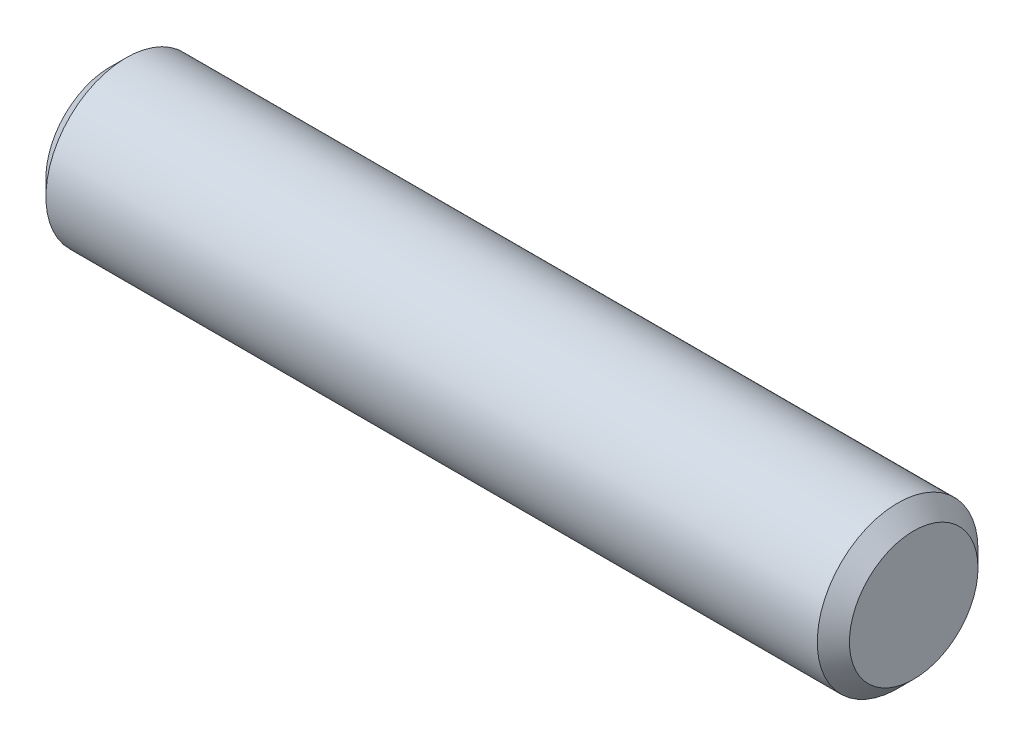
ISO-10303-21;
HEADER;
FILE_DESCRIPTION(('STEP AP214'),'2;1');
FILE_NAME('part.step','',(''),(''),'','','');
FILE_SCHEMA(('AUTOMOTIVE_DESIGN { 1 0 10303 214 1 1 1 1 }'));
ENDSEC;
DATA;
#1=APPLICATION_CONTEXT('core data for automotive mechanical design processes');
#2=APPLICATION_PROTOCOL_DEFINITION('international standard','automotive_design',2000,#1);
#3=PRODUCT_CONTEXT('',#1,'mechanical');
#4=PRODUCT('Part','Part','',(#3));
#5=PRODUCT_RELATED_PRODUCT_CATEGORY('part','',(#4));
#6=PRODUCT_DEFINITION_FORMATION('','',#4);
#7=PRODUCT_DEFINITION_CONTEXT('part definition',#1,'design');
#8=PRODUCT_DEFINITION('design','',#6,#7);
#9=PRODUCT_DEFINITION_SHAPE('','',#8);
#10=(LENGTH_UNIT() NAMED_UNIT(*) SI_UNIT(.MILLI.,.METRE.));
#11=(NAMED_UNIT(*) PLANE_ANGLE_UNIT() SI_UNIT($,.RADIAN.));
#12=(NAMED_UNIT(*) SI_UNIT($,.STERADIAN.) SOLID_ANGLE_UNIT());
#13=UNCERTAINTY_MEASURE_WITH_UNIT(LENGTH_MEASURE(1.E-05),#10,'distance_accuracy_value','');
#14=(GEOMETRIC_REPRESENTATION_CONTEXT(3) GLOBAL_UNCERTAINTY_ASSIGNED_CONTEXT((#13)) GLOBAL_UNIT_ASSIGNED_CONTEXT((#10,
#11,#12)) REPRESENTATION_CONTEXT('',''));
#15=CARTESIAN_POINT('',(0.,0.,0.));
#16=DIRECTION('',(0.,0.,1.));
#17=DIRECTION('',(1.,0.,0.));
#18=AXIS2_PLACEMENT_3D('',#15,#16,#17);
#19=CARTESIAN_POINT('',(-15.875,0.,0.));
#20=DIRECTION('',(1.,0.,0.));
#21=DIRECTION('',(0.,0.,-1.));
#22=AXIS2_PLACEMENT_3D('',#19,#20,#21);
#23=CYLINDRICAL_SURFACE('',#22,3.175);
#24=CARTESIAN_POINT('',(15.24,0.,0.));
#25=DIRECTION('',(1.,0.,0.));
#26=DIRECTION('',(0.,0.,-1.));
#27=AXIS2_PLACEMENT_3D('',#24,#25,#26);
#28=CIRCLE('',#27,3.175);
#29=CARTESIAN_POINT('',(15.24,0.,-3.175));
#30=VERTEX_POINT('',#29);
#31=EDGE_CURVE('E39',#30,#30,#28,.F.);
#32=ORIENTED_EDGE('',*,*,#31,.T.);
#33=EDGE_LOOP('',(#32));
#34=FACE_BOUND('',#33,.T.);
#35=CARTESIAN_POINT('',(-15.24,0.,0.));
#36=DIRECTION('',(1.,0.,0.));
#37=DIRECTION('',(0.,0.,-1.));
#38=AXIS2_PLACEMENT_3D('',#35,#36,#37);
#39=CIRCLE('',#38,3.175);
#40=CARTESIAN_POINT('',(-15.24,0.,-3.175));
#41=VERTEX_POINT('',#40);
#42=EDGE_CURVE('E43',#41,#41,#39,.T.);
#43=ORIENTED_EDGE('',*,*,#42,.T.);
#44=EDGE_LOOP('',(#43));
#45=FACE_BOUND('',#44,.T.);
#46=ADVANCED_FACE('F32',(#34,#45),#23,.T.);
#47=CARTESIAN_POINT('',(-15.875,0.,0.));
#48=DIRECTION('',(1.,0.,0.));
#49=DIRECTION('',(0.,0.,-1.));
#50=AXIS2_PLACEMENT_3D('',#47,#48,#49);
#51=PLANE('',#50);
#52=CARTESIAN_POINT('',(-15.875,0.,0.));
#53=DIRECTION('',(1.,0.,0.));
#54=DIRECTION('',(0.,0.,-1.));
#55=AXIS2_PLACEMENT_3D('',#52,#53,#54);
#56=CIRCLE('',#55,2.54);
#57=CARTESIAN_POINT('',(-15.875,0.,-2.54));
#58=VERTEX_POINT('',#57);
#59=EDGE_CURVE('E10',#58,#58,#56,.F.);
#60=ORIENTED_EDGE('',*,*,#59,.T.);
#61=EDGE_LOOP('',(#60));
#62=FACE_BOUND('',#61,.T.);
#63=ADVANCED_FACE('F63',(#62),#51,.F.);
#64=CARTESIAN_POINT('',(15.875,0.,0.));
#65=DIRECTION('',(1.,0.,0.));
#66=DIRECTION('',(0.,0.,-1.));
#67=AXIS2_PLACEMENT_3D('',#64,#65,#66);
#68=PLANE('',#67);
#69=CARTESIAN_POINT('',(15.875,0.,0.));
#70=DIRECTION('',(1.,0.,0.));
#71=DIRECTION('',(0.,0.,-1.));
#72=AXIS2_PLACEMENT_3D('',#69,#70,#71);
#73=CIRCLE('',#72,2.54);
#74=CARTESIAN_POINT('',(15.875,0.,-2.54));
#75=VERTEX_POINT('',#74);
#76=EDGE_CURVE('E47',#75,#75,#73,.T.);
#77=ORIENTED_EDGE('',*,*,#76,.T.);
#78=EDGE_LOOP('',(#77));
#79=FACE_BOUND('',#78,.T.);
#80=ADVANCED_FACE('F53',(#79),#68,.T.);
#81=CARTESIAN_POINT('',(15.875,0.,0.));
#82=DIRECTION('',(-1.,0.,0.));
#83=DIRECTION('',(0.,0.,1.));
#84=AXIS2_PLACEMENT_3D('',#81,#82,#83);
#85=CONICAL_SURFACE('',#84,2.54,0.785398163397445);
#86=ORIENTED_EDGE('',*,*,#31,.F.);
#87=EDGE_LOOP('',(#86));
#88=FACE_BOUND('',#87,.T.);
#89=ORIENTED_EDGE('',*,*,#76,.F.);
#90=EDGE_LOOP('',(#89));
#91=FACE_BOUND('',#90,.T.);
#92=ADVANCED_FACE('F55',(#88,#91),#85,.T.);
#93=CARTESIAN_POINT('',(-15.24,0.,0.));
#94=DIRECTION('',(1.,0.,0.));
#95=DIRECTION('',(0.,0.,-1.));
#96=AXIS2_PLACEMENT_3D('',#93,#94,#95);
#97=CONICAL_SURFACE('',#96,3.175,0.78539816339745);
#98=ORIENTED_EDGE('',*,*,#59,.F.);
#99=EDGE_LOOP('',(#98));
#100=FACE_BOUND('',#99,.T.);
#101=ORIENTED_EDGE('',*,*,#42,.F.);
#102=EDGE_LOOP('',(#101));
#103=FACE_BOUND('',#102,.T.);
#104=ADVANCED_FACE('F34',(#100,#103),#97,.T.);
#105=CLOSED_SHELL('',(#46,#63,#80,#92,#104));
#106=MANIFOLD_SOLID_BREP('B2',#105);
#107=ADVANCED_BREP_SHAPE_REPRESENTATION('',(#18,#106),#14);
#108=SHAPE_DEFINITION_REPRESENTATION(#9,#107);
ENDSEC;
END-ISO-10303-21;
